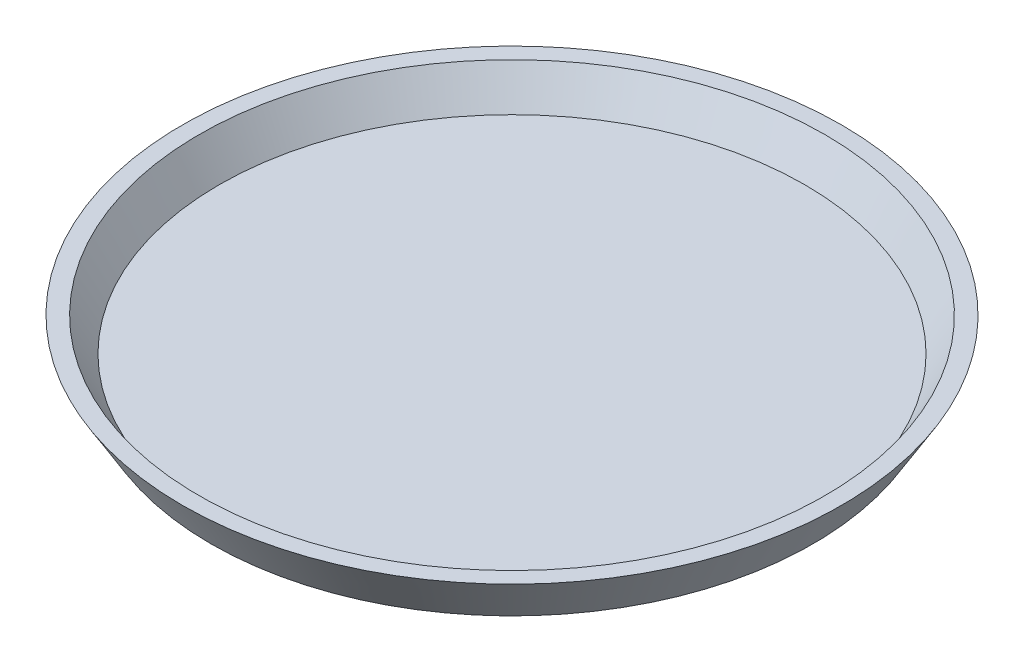
ISO-10303-21;
HEADER;
FILE_DESCRIPTION(('STEP AP214'),'2;1');
FILE_NAME('part.step','',(''),(''),'','','');
FILE_SCHEMA(('AUTOMOTIVE_DESIGN { 1 0 10303 214 1 1 1 1 }'));
ENDSEC;
DATA;
#1=APPLICATION_CONTEXT('core data for automotive mechanical design processes');
#2=APPLICATION_PROTOCOL_DEFINITION('international standard','automotive_design',2000,#1);
#3=PRODUCT_CONTEXT('',#1,'mechanical');
#4=PRODUCT('Part','Part','',(#3));
#5=PRODUCT_RELATED_PRODUCT_CATEGORY('part','',(#4));
#6=PRODUCT_DEFINITION_FORMATION('','',#4);
#7=PRODUCT_DEFINITION_CONTEXT('part definition',#1,'design');
#8=PRODUCT_DEFINITION('design','',#6,#7);
#9=PRODUCT_DEFINITION_SHAPE('','',#8);
#10=(LENGTH_UNIT() NAMED_UNIT(*) SI_UNIT(.MILLI.,.METRE.));
#11=(NAMED_UNIT(*) PLANE_ANGLE_UNIT() SI_UNIT($,.RADIAN.));
#12=(NAMED_UNIT(*) SI_UNIT($,.STERADIAN.) SOLID_ANGLE_UNIT());
#13=UNCERTAINTY_MEASURE_WITH_UNIT(LENGTH_MEASURE(1.E-05),#10,'distance_accuracy_value','');
#14=(GEOMETRIC_REPRESENTATION_CONTEXT(3) GLOBAL_UNCERTAINTY_ASSIGNED_CONTEXT((#13)) GLOBAL_UNIT_ASSIGNED_CONTEXT((#10,
#11,#12)) REPRESENTATION_CONTEXT('',''));
#15=CARTESIAN_POINT('',(0.,0.,0.));
#16=DIRECTION('',(0.,0.,1.));
#17=DIRECTION('',(1.,0.,0.));
#18=AXIS2_PLACEMENT_3D('',#15,#16,#17);
#19=CARTESIAN_POINT('',(0.,3.,0.));
#20=DIRECTION('',(0.,1.,0.));
#21=DIRECTION('',(0.,0.,1.));
#22=AXIS2_PLACEMENT_3D('',#19,#20,#21);
#23=PLANE('',#22);
#24=CARTESIAN_POINT('',(0.,3.,0.));
#25=DIRECTION('',(0.,-1.,0.));
#26=DIRECTION('',(0.,0.,-1.));
#27=AXIS2_PLACEMENT_3D('',#24,#25,#26);
#28=CIRCLE('',#27,61.3014288630928);
#29=CARTESIAN_POINT('',(0.,3.,-61.3014288630928));
#30=VERTEX_POINT('',#29);
#31=EDGE_CURVE('E10',#30,#30,#28,.T.);
#32=ORIENTED_EDGE('',*,*,#31,.F.);
#33=EDGE_LOOP('',(#32));
#34=FACE_BOUND('',#33,.T.);
#35=ADVANCED_FACE('F43',(#34),#23,.T.);
#36=CARTESIAN_POINT('',(0.,10.,0.));
#37=DIRECTION('',(0.,1.,0.));
#38=DIRECTION('',(0.,0.,1.));
#39=AXIS2_PLACEMENT_3D('',#36,#37,#38);
#40=CONICAL_SURFACE('',#39,65.5014288630928,0.540419500270584);
#41=ORIENTED_EDGE('',*,*,#31,.T.);
#42=EDGE_LOOP('',(#41));
#43=FACE_BOUND('',#42,.T.);
#44=CARTESIAN_POINT('',(0.,10.,0.));
#45=DIRECTION('',(0.,-1.,0.));
#46=DIRECTION('',(0.,0.,-1.));
#47=AXIS2_PLACEMENT_3D('',#44,#45,#46);
#48=CIRCLE('',#47,65.5014288630928);
#49=CARTESIAN_POINT('',(0.,10.,-65.5014288630928));
#50=VERTEX_POINT('',#49);
#51=EDGE_CURVE('E49',#50,#50,#48,.T.);
#52=ORIENTED_EDGE('',*,*,#51,.F.);
#53=EDGE_LOOP('',(#52));
#54=FACE_BOUND('',#53,.T.);
#55=ADVANCED_FACE('F75',(#43,#54),#40,.F.);
#56=CARTESIAN_POINT('',(69.,10.,0.));
#57=DIRECTION('',(0.,1.,0.));
#58=DIRECTION('',(0.,0.,1.));
#59=AXIS2_PLACEMENT_3D('',#56,#57,#58);
#60=PLANE('',#59);
#61=ORIENTED_EDGE('',*,*,#51,.T.);
#62=EDGE_LOOP('',(#61));
#63=FACE_BOUND('',#62,.T.);
#64=CARTESIAN_POINT('',(0.,10.,0.));
#65=DIRECTION('',(0.,-1.,0.));
#66=DIRECTION('',(0.,0.,-1.));
#67=AXIS2_PLACEMENT_3D('',#64,#65,#66);
#68=CIRCLE('',#67,69.);
#69=CARTESIAN_POINT('',(0.,10.,-69.));
#70=VERTEX_POINT('',#69);
#71=EDGE_CURVE('E53',#70,#70,#68,.T.);
#72=ORIENTED_EDGE('',*,*,#71,.F.);
#73=EDGE_LOOP('',(#72));
#74=FACE_BOUND('',#73,.T.);
#75=ADVANCED_FACE('F67',(#63,#74),#60,.T.);
#76=CARTESIAN_POINT('',(0.,0.,0.));
#77=DIRECTION('',(0.,1.,0.));
#78=DIRECTION('',(0.,0.,1.));
#79=AXIS2_PLACEMENT_3D('',#76,#77,#78);
#80=CONICAL_SURFACE('',#79,63.,0.540419500270584);
#81=ORIENTED_EDGE('',*,*,#71,.T.);
#82=EDGE_LOOP('',(#81));
#83=FACE_BOUND('',#82,.T.);
#84=CARTESIAN_POINT('',(0.,0.,0.));
#85=DIRECTION('',(0.,-1.,0.));
#86=DIRECTION('',(0.,0.,-1.));
#87=AXIS2_PLACEMENT_3D('',#84,#85,#86);
#88=CIRCLE('',#87,63.);
#89=CARTESIAN_POINT('',(0.,0.,-63.));
#90=VERTEX_POINT('',#89);
#91=EDGE_CURVE('E57',#90,#90,#88,.T.);
#92=ORIENTED_EDGE('',*,*,#91,.F.);
#93=EDGE_LOOP('',(#92));
#94=FACE_BOUND('',#93,.T.);
#95=ADVANCED_FACE('F65',(#83,#94),#80,.T.);
#96=CARTESIAN_POINT('',(0.,0.,0.));
#97=DIRECTION('',(0.,-1.,0.));
#98=DIRECTION('',(0.,0.,-1.));
#99=AXIS2_PLACEMENT_3D('',#96,#97,#98);
#100=PLANE('',#99);
#101=ORIENTED_EDGE('',*,*,#91,.T.);
#102=EDGE_LOOP('',(#101));
#103=FACE_BOUND('',#102,.T.);
#104=ADVANCED_FACE('F63',(#103),#100,.T.);
#105=CLOSED_SHELL('',(#35,#55,#75,#95,#104));
#106=MANIFOLD_SOLID_BREP('B2',#105);
#107=ADVANCED_BREP_SHAPE_REPRESENTATION('',(#18,#106),#14);
#108=SHAPE_DEFINITION_REPRESENTATION(#9,#107);
ENDSEC;
END-ISO-10303-21;
